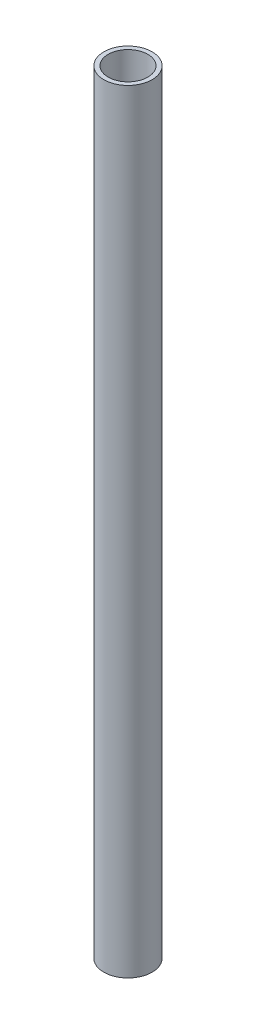
ISO-10303-21;
HEADER;
FILE_DESCRIPTION(('STEP AP214'),'2;1');
FILE_NAME('part.step','',(''),(''),'','','');
FILE_SCHEMA(('AUTOMOTIVE_DESIGN { 1 0 10303 214 1 1 1 1 }'));
ENDSEC;
DATA;
#1=APPLICATION_CONTEXT('core data for automotive mechanical design processes');
#2=APPLICATION_PROTOCOL_DEFINITION('international standard','automotive_design',2000,#1);
#3=PRODUCT_CONTEXT('',#1,'mechanical');
#4=PRODUCT('Part','Part','',(#3));
#5=PRODUCT_RELATED_PRODUCT_CATEGORY('part','',(#4));
#6=PRODUCT_DEFINITION_FORMATION('','',#4);
#7=PRODUCT_DEFINITION_CONTEXT('part definition',#1,'design');
#8=PRODUCT_DEFINITION('design','',#6,#7);
#9=PRODUCT_DEFINITION_SHAPE('','',#8);
#10=(LENGTH_UNIT() NAMED_UNIT(*) SI_UNIT(.MILLI.,.METRE.));
#11=(NAMED_UNIT(*) PLANE_ANGLE_UNIT() SI_UNIT($,.RADIAN.));
#12=(NAMED_UNIT(*) SI_UNIT($,.STERADIAN.) SOLID_ANGLE_UNIT());
#13=UNCERTAINTY_MEASURE_WITH_UNIT(LENGTH_MEASURE(1.E-05),#10,'distance_accuracy_value','');
#14=(GEOMETRIC_REPRESENTATION_CONTEXT(3) GLOBAL_UNCERTAINTY_ASSIGNED_CONTEXT((#13)) GLOBAL_UNIT_ASSIGNED_CONTEXT((#10,
#11,#12)) REPRESENTATION_CONTEXT('',''));
#15=CARTESIAN_POINT('',(0.,0.,0.));
#16=DIRECTION('',(0.,0.,1.));
#17=DIRECTION('',(1.,0.,0.));
#18=AXIS2_PLACEMENT_3D('',#15,#16,#17);
#19=CARTESIAN_POINT('',(0.,406.4,0.));
#20=DIRECTION('',(0.,1.,0.));
#21=DIRECTION('',(0.,0.,1.));
#22=AXIS2_PLACEMENT_3D('',#19,#20,#21);
#23=PLANE('',#22);
#24=CARTESIAN_POINT('',(0.,406.4,0.));
#25=DIRECTION('',(0.,1.,0.));
#26=DIRECTION('',(0.,0.,1.));
#27=AXIS2_PLACEMENT_3D('',#24,#25,#26);
#28=CIRCLE('',#27,12.7);
#29=CARTESIAN_POINT('',(0.,406.4,12.7));
#30=VERTEX_POINT('',#29);
#31=EDGE_CURVE('E10',#30,#30,#28,.T.);
#32=ORIENTED_EDGE('',*,*,#31,.T.);
#33=EDGE_LOOP('',(#32));
#34=FACE_BOUND('',#33,.T.);
#35=CARTESIAN_POINT('',(0.,406.4,0.));
#36=DIRECTION('',(0.,1.,0.));
#37=DIRECTION('',(0.,0.,1.));
#38=AXIS2_PLACEMENT_3D('',#35,#36,#37);
#39=CIRCLE('',#38,10.414);
#40=CARTESIAN_POINT('',(0.,406.4,10.414));
#41=VERTEX_POINT('',#40);
#42=EDGE_CURVE('E42',#41,#41,#39,.T.);
#43=ORIENTED_EDGE('',*,*,#42,.F.);
#44=EDGE_LOOP('',(#43));
#45=FACE_BOUND('',#44,.T.);
#46=ADVANCED_FACE('F31',(#34,#45),#23,.T.);
#47=CARTESIAN_POINT('',(0.,0.,0.));
#48=DIRECTION('',(0.,1.,0.));
#49=DIRECTION('',(0.,0.,1.));
#50=AXIS2_PLACEMENT_3D('',#47,#48,#49);
#51=PLANE('',#50);
#52=CARTESIAN_POINT('',(0.,0.,0.));
#53=DIRECTION('',(0.,1.,0.));
#54=DIRECTION('',(0.,0.,1.));
#55=AXIS2_PLACEMENT_3D('',#52,#53,#54);
#56=CIRCLE('',#55,12.7);
#57=CARTESIAN_POINT('',(0.,0.,12.7));
#58=VERTEX_POINT('',#57);
#59=EDGE_CURVE('E35',#58,#58,#56,.T.);
#60=ORIENTED_EDGE('',*,*,#59,.F.);
#61=EDGE_LOOP('',(#60));
#62=FACE_BOUND('',#61,.T.);
#63=CARTESIAN_POINT('',(0.,0.,0.));
#64=DIRECTION('',(0.,1.,0.));
#65=DIRECTION('',(0.,0.,1.));
#66=AXIS2_PLACEMENT_3D('',#63,#64,#65);
#67=CIRCLE('',#66,10.414);
#68=CARTESIAN_POINT('',(0.,0.,10.414));
#69=VERTEX_POINT('',#68);
#70=EDGE_CURVE('E44',#69,#69,#67,.T.);
#71=ORIENTED_EDGE('',*,*,#70,.T.);
#72=EDGE_LOOP('',(#71));
#73=FACE_BOUND('',#72,.T.);
#74=ADVANCED_FACE('F54',(#62,#73),#51,.F.);
#75=CARTESIAN_POINT('',(0.,406.4,0.));
#76=DIRECTION('',(0.,-1.,0.));
#77=DIRECTION('',(0.,0.,-1.));
#78=AXIS2_PLACEMENT_3D('',#75,#76,#77);
#79=CYLINDRICAL_SURFACE('',#78,12.7);
#80=ORIENTED_EDGE('',*,*,#31,.F.);
#81=EDGE_LOOP('',(#80));
#82=FACE_BOUND('',#81,.T.);
#83=ORIENTED_EDGE('',*,*,#59,.T.);
#84=EDGE_LOOP('',(#83));
#85=FACE_BOUND('',#84,.T.);
#86=ADVANCED_FACE('F33',(#82,#85),#79,.T.);
#87=CARTESIAN_POINT('',(0.,406.4,0.));
#88=DIRECTION('',(0.,-1.,0.));
#89=DIRECTION('',(0.,0.,-1.));
#90=AXIS2_PLACEMENT_3D('',#87,#88,#89);
#91=CYLINDRICAL_SURFACE('',#90,10.414);
#92=ORIENTED_EDGE('',*,*,#42,.T.);
#93=EDGE_LOOP('',(#92));
#94=FACE_BOUND('',#93,.T.);
#95=ORIENTED_EDGE('',*,*,#70,.F.);
#96=EDGE_LOOP('',(#95));
#97=FACE_BOUND('',#96,.T.);
#98=ADVANCED_FACE('F50',(#94,#97),#91,.F.);
#99=CLOSED_SHELL('',(#46,#74,#86,#98));
#100=MANIFOLD_SOLID_BREP('B2',#99);
#101=ADVANCED_BREP_SHAPE_REPRESENTATION('',(#18,#100),#14);
#102=SHAPE_DEFINITION_REPRESENTATION(#9,#101);
ENDSEC;
END-ISO-10303-21;
